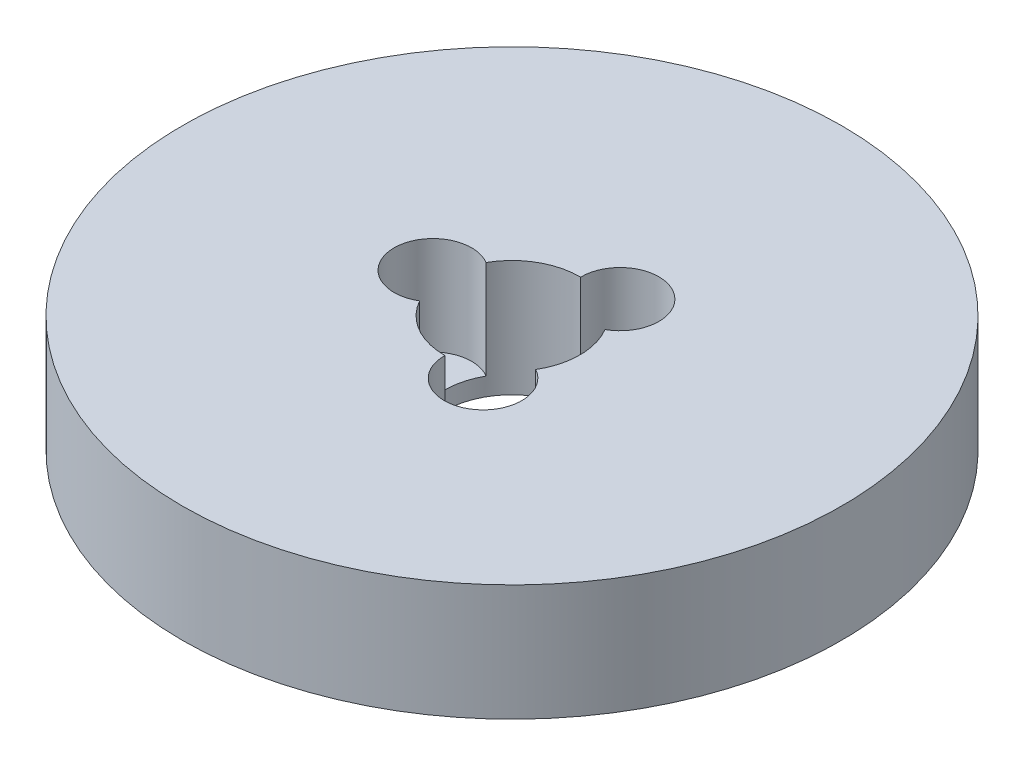
ISO-10303-21;
HEADER;
FILE_DESCRIPTION(('STEP AP214'),'2;1');
FILE_NAME('part.step','',(''),(''),'','','');
FILE_SCHEMA(('AUTOMOTIVE_DESIGN { 1 0 10303 214 1 1 1 1 }'));
ENDSEC;
DATA;
#1=APPLICATION_CONTEXT('core data for automotive mechanical design processes');
#2=APPLICATION_PROTOCOL_DEFINITION('international standard','automotive_design',2000,#1);
#3=PRODUCT_CONTEXT('',#1,'mechanical');
#4=PRODUCT('Part','Part','',(#3));
#5=PRODUCT_RELATED_PRODUCT_CATEGORY('part','',(#4));
#6=PRODUCT_DEFINITION_FORMATION('','',#4);
#7=PRODUCT_DEFINITION_CONTEXT('part definition',#1,'design');
#8=PRODUCT_DEFINITION('design','',#6,#7);
#9=PRODUCT_DEFINITION_SHAPE('','',#8);
#10=(LENGTH_UNIT() NAMED_UNIT(*) SI_UNIT(.MILLI.,.METRE.));
#11=(NAMED_UNIT(*) PLANE_ANGLE_UNIT() SI_UNIT($,.RADIAN.));
#12=(NAMED_UNIT(*) SI_UNIT($,.STERADIAN.) SOLID_ANGLE_UNIT());
#13=UNCERTAINTY_MEASURE_WITH_UNIT(LENGTH_MEASURE(1.E-05),#10,'distance_accuracy_value','');
#14=(GEOMETRIC_REPRESENTATION_CONTEXT(3) GLOBAL_UNCERTAINTY_ASSIGNED_CONTEXT((#13)) GLOBAL_UNIT_ASSIGNED_CONTEXT((#10,
#11,#12)) REPRESENTATION_CONTEXT('',''));
#15=CARTESIAN_POINT('',(0.,0.,0.));
#16=DIRECTION('',(0.,0.,1.));
#17=DIRECTION('',(1.,0.,0.));
#18=AXIS2_PLACEMENT_3D('',#15,#16,#17);
#19=CARTESIAN_POINT('',(0.,30.,0.));
#20=DIRECTION('',(0.,-1.,0.));
#21=DIRECTION('',(0.,0.,-1.));
#22=AXIS2_PLACEMENT_3D('',#19,#20,#21);
#23=CYLINDRICAL_SURFACE('',#22,85.);
#24=CARTESIAN_POINT('',(0.,30.,0.));
#25=DIRECTION('',(0.,1.,0.));
#26=DIRECTION('',(0.,0.,1.));
#27=AXIS2_PLACEMENT_3D('',#24,#25,#26);
#28=CIRCLE('',#27,85.);
#29=CARTESIAN_POINT('',(0.,30.,85.));
#30=VERTEX_POINT('',#29);
#31=EDGE_CURVE('E126',#30,#30,#28,.T.);
#32=ORIENTED_EDGE('',*,*,#31,.F.);
#33=EDGE_LOOP('',(#32));
#34=FACE_BOUND('',#33,.T.);
#35=CARTESIAN_POINT('',(0.,0.,0.));
#36=DIRECTION('',(0.,1.,0.));
#37=DIRECTION('',(0.,0.,1.));
#38=AXIS2_PLACEMENT_3D('',#35,#36,#37);
#39=CIRCLE('',#38,85.);
#40=CARTESIAN_POINT('',(0.,0.,85.));
#41=VERTEX_POINT('',#40);
#42=EDGE_CURVE('E124',#41,#41,#39,.T.);
#43=ORIENTED_EDGE('',*,*,#42,.T.);
#44=EDGE_LOOP('',(#43));
#45=FACE_BOUND('',#44,.T.);
#46=ADVANCED_FACE('F39',(#34,#45),#23,.T.);
#47=CARTESIAN_POINT('',(0.,30.,0.));
#48=DIRECTION('',(0.,1.,0.));
#49=DIRECTION('',(0.,0.,1.));
#50=AXIS2_PLACEMENT_3D('',#47,#48,#49);
#51=PLANE('',#50);
#52=CARTESIAN_POINT('',(10.2060339267064,30.,17.6773693048269));
#53=DIRECTION('',(0.,1.,0.));
#54=DIRECTION('',(0.866025403784436,0.,-0.500000000000004));
#55=AXIS2_PLACEMENT_3D('',#52,#53,#54);
#56=CIRCLE('',#55,10.);
#57=CARTESIAN_POINT('',(0.207628970782858,30.,17.4987682483794));
#58=VERTEX_POINT('',#57);
#59=CARTESIAN_POINT('',(15.0505633526418,30.,8.92919608744915));
#60=VERTEX_POINT('',#59);
#61=EDGE_CURVE('E147',#58,#60,#56,.T.);
#62=ORIENTED_EDGE('',*,*,#61,.F.);
#63=CARTESIAN_POINT('',(0.,30.,0.));
#64=DIRECTION('',(0.,1.,0.));
#65=DIRECTION('',(0.,0.,1.));
#66=AXIS2_PLACEMENT_3D('',#63,#64,#65);
#67=CIRCLE('',#66,17.5);
#68=CARTESIAN_POINT('',(-15.2581923234245,30.,8.56957216093021));
#69=VERTEX_POINT('',#68);
#70=EDGE_CURVE('E118',#69,#58,#67,.T.);
#71=ORIENTED_EDGE('',*,*,#70,.F.);
#72=CARTESIAN_POINT('',(-20.4120678534126,30.,0.));
#73=DIRECTION('',(0.,1.,0.));
#74=DIRECTION('',(0.,0.,1.));
#75=AXIS2_PLACEMENT_3D('',#72,#73,#74);
#76=CIRCLE('',#75,10.);
#77=CARTESIAN_POINT('',(-15.2581923234245,30.,-8.56957216093021));
#78=VERTEX_POINT('',#77);
#79=EDGE_CURVE('E113',#78,#69,#76,.T.);
#80=ORIENTED_EDGE('',*,*,#79,.F.);
#81=CARTESIAN_POINT('',(0.207628970782612,30.,-17.4987682483794));
#82=VERTEX_POINT('',#81);
#83=EDGE_CURVE('E106',#82,#78,#67,.T.);
#84=ORIENTED_EDGE('',*,*,#83,.F.);
#85=CARTESIAN_POINT('',(10.2060339267061,30.,-17.6773693048271));
#86=DIRECTION('',(0.,1.,0.));
#87=DIRECTION('',(-0.866025403784443,0.,-0.499999999999992));
#88=AXIS2_PLACEMENT_3D('',#85,#86,#87);
#89=CIRCLE('',#88,10.);
#90=CARTESIAN_POINT('',(15.0505633526416,30.,-8.92919608744935));
#91=VERTEX_POINT('',#90);
#92=EDGE_CURVE('E90',#91,#82,#89,.T.);
#93=ORIENTED_EDGE('',*,*,#92,.F.);
#94=EDGE_CURVE('E116',#60,#91,#67,.T.);
#95=ORIENTED_EDGE('',*,*,#94,.F.);
#96=EDGE_LOOP('',(#62,#71,#80,#84,#93,#95));
#97=FACE_BOUND('',#96,.T.);
#98=ORIENTED_EDGE('',*,*,#31,.T.);
#99=EDGE_LOOP('',(#98));
#100=FACE_BOUND('',#99,.T.);
#101=ADVANCED_FACE('F115',(#97,#100),#51,.T.);
#102=CARTESIAN_POINT('',(0.,0.,0.));
#103=DIRECTION('',(0.,1.,0.));
#104=DIRECTION('',(0.,0.,1.));
#105=AXIS2_PLACEMENT_3D('',#102,#103,#104);
#106=PLANE('',#105);
#107=CARTESIAN_POINT('',(0.,0.,0.));
#108=DIRECTION('',(0.,1.,0.));
#109=DIRECTION('',(0.,0.,1.));
#110=AXIS2_PLACEMENT_3D('',#107,#108,#109);
#111=CIRCLE('',#110,17.5);
#112=CARTESIAN_POINT('',(0.,0.,17.5));
#113=VERTEX_POINT('',#112);
#114=EDGE_CURVE('E120',#113,#113,#111,.T.);
#115=ORIENTED_EDGE('',*,*,#114,.T.);
#116=EDGE_LOOP('',(#115));
#117=FACE_BOUND('',#116,.T.);
#118=ORIENTED_EDGE('',*,*,#42,.F.);
#119=EDGE_LOOP('',(#118));
#120=FACE_BOUND('',#119,.T.);
#121=ADVANCED_FACE('F164',(#117,#120),#106,.F.);
#122=CARTESIAN_POINT('',(0.,30.,0.));
#123=DIRECTION('',(0.,-1.,0.));
#124=DIRECTION('',(0.,0.,-1.));
#125=AXIS2_PLACEMENT_3D('',#122,#123,#124);
#126=CYLINDRICAL_SURFACE('',#125,17.5);
#127=DIRECTION('',(0.,1.,0.));
#128=VECTOR('',#127,1.);
#129=CARTESIAN_POINT('',(0.207628970782858,17.3187324811393,17.4987682483794));
#130=LINE('',#129,#128);
#131=CARTESIAN_POINT('',(0.207628970782858,4.6374649622787,17.4987682483794));
#132=VERTEX_POINT('',#131);
#133=EDGE_CURVE('E11',#132,#58,#130,.T.);
#134=ORIENTED_EDGE('',*,*,#133,.F.);
#135=CARTESIAN_POINT('',(0.,4.6374649622787,0.));
#136=DIRECTION('',(0.,1.,0.));
#137=DIRECTION('',(0.,0.,1.));
#138=AXIS2_PLACEMENT_3D('',#135,#136,#137);
#139=CIRCLE('',#138,17.5);
#140=CARTESIAN_POINT('',(15.0505633526418,4.6374649622787,8.92919608744915));
#141=VERTEX_POINT('',#140);
#142=EDGE_CURVE('E144',#132,#141,#139,.T.);
#143=ORIENTED_EDGE('',*,*,#142,.T.);
#144=DIRECTION('',(0.,1.,0.));
#145=VECTOR('',#144,1.);
#146=CARTESIAN_POINT('',(15.0505633526418,17.3187324811393,8.92919608744915));
#147=LINE('',#146,#145);
#148=EDGE_CURVE('E46',#60,#141,#147,.F.);
#149=ORIENTED_EDGE('',*,*,#148,.F.);
#150=ORIENTED_EDGE('',*,*,#94,.T.);
#151=DIRECTION('',(0.,1.,0.));
#152=VECTOR('',#151,1.);
#153=CARTESIAN_POINT('',(15.0505633526416,17.3187324811393,-8.92919608744935));
#154=LINE('',#153,#152);
#155=CARTESIAN_POINT('',(15.0505633526416,4.6374649622787,-8.92919608744935));
#156=VERTEX_POINT('',#155);
#157=EDGE_CURVE('E92',#156,#91,#154,.T.);
#158=ORIENTED_EDGE('',*,*,#157,.F.);
#159=CARTESIAN_POINT('',(0.,4.6374649622787,0.));
#160=DIRECTION('',(0.,1.,0.));
#161=DIRECTION('',(0.,0.,1.));
#162=AXIS2_PLACEMENT_3D('',#159,#160,#161);
#163=CIRCLE('',#162,17.5);
#164=CARTESIAN_POINT('',(0.207628970782612,4.6374649622787,-17.4987682483794));
#165=VERTEX_POINT('',#164);
#166=EDGE_CURVE('E107',#156,#165,#163,.T.);
#167=ORIENTED_EDGE('',*,*,#166,.T.);
#168=DIRECTION('',(0.,1.,0.));
#169=VECTOR('',#168,1.);
#170=CARTESIAN_POINT('',(0.207628970782612,17.3187324811393,-17.4987682483794));
#171=LINE('',#170,#169);
#172=EDGE_CURVE('E95',#82,#165,#171,.F.);
#173=ORIENTED_EDGE('',*,*,#172,.F.);
#174=ORIENTED_EDGE('',*,*,#83,.T.);
#175=DIRECTION('',(0.,1.,0.));
#176=VECTOR('',#175,1.);
#177=CARTESIAN_POINT('',(-15.2581923234245,17.3187324811393,-8.56957216093021));
#178=LINE('',#177,#176);
#179=CARTESIAN_POINT('',(-15.2581923234245,4.6374649622787,-8.56957216093021));
#180=VERTEX_POINT('',#179);
#181=EDGE_CURVE('E143',#180,#78,#178,.T.);
#182=ORIENTED_EDGE('',*,*,#181,.F.);
#183=CARTESIAN_POINT('',(0.,4.6374649622787,0.));
#184=DIRECTION('',(0.,1.,0.));
#185=DIRECTION('',(0.,0.,1.));
#186=AXIS2_PLACEMENT_3D('',#183,#184,#185);
#187=CIRCLE('',#186,17.5);
#188=CARTESIAN_POINT('',(-15.2581923234245,4.6374649622787,8.56957216093021));
#189=VERTEX_POINT('',#188);
#190=EDGE_CURVE('E132',#180,#189,#187,.T.);
#191=ORIENTED_EDGE('',*,*,#190,.T.);
#192=DIRECTION('',(0.,1.,0.));
#193=VECTOR('',#192,1.);
#194=CARTESIAN_POINT('',(-15.2581923234245,17.3187324811393,8.56957216093021));
#195=LINE('',#194,#193);
#196=EDGE_CURVE('E137',#69,#189,#195,.F.);
#197=ORIENTED_EDGE('',*,*,#196,.F.);
#198=ORIENTED_EDGE('',*,*,#70,.T.);
#199=EDGE_LOOP('',(#134,#143,#149,#150,#158,#167,#173,#174,#182,#191,#197,#198));
#200=FACE_BOUND('',#199,.T.);
#201=ORIENTED_EDGE('',*,*,#114,.F.);
#202=EDGE_LOOP('',(#201));
#203=FACE_BOUND('',#202,.T.);
#204=ADVANCED_FACE('F103',(#200,#203),#126,.F.);
#205=CARTESIAN_POINT('',(-20.4120678534126,4.6374649622787,0.));
#206=DIRECTION('',(0.,1.,0.));
#207=DIRECTION('',(0.,0.,1.));
#208=AXIS2_PLACEMENT_3D('',#205,#206,#207);
#209=CYLINDRICAL_SURFACE('',#208,10.);
#210=ORIENTED_EDGE('',*,*,#181,.T.);
#211=ORIENTED_EDGE('',*,*,#79,.T.);
#212=ORIENTED_EDGE('',*,*,#196,.T.);
#213=CARTESIAN_POINT('',(-20.4120678534126,4.6374649622787,0.));
#214=DIRECTION('',(0.,1.,0.));
#215=DIRECTION('',(0.,0.,1.));
#216=AXIS2_PLACEMENT_3D('',#213,#214,#215);
#217=CIRCLE('',#216,10.);
#218=EDGE_CURVE('E121',#180,#189,#217,.T.);
#219=ORIENTED_EDGE('',*,*,#218,.F.);
#220=EDGE_LOOP('',(#210,#211,#212,#219));
#221=FACE_BOUND('',#220,.T.);
#222=ADVANCED_FACE('F174',(#221),#209,.F.);
#223=CARTESIAN_POINT('',(-20.4120678534126,4.6374649622787,0.));
#224=DIRECTION('',(0.,1.,0.));
#225=DIRECTION('',(0.,0.,1.));
#226=AXIS2_PLACEMENT_3D('',#223,#224,#225);
#227=PLANE('',#226);
#228=ORIENTED_EDGE('',*,*,#218,.T.);
#229=ORIENTED_EDGE('',*,*,#190,.F.);
#230=EDGE_LOOP('',(#228,#229));
#231=FACE_BOUND('',#230,.T.);
#232=ADVANCED_FACE('F177',(#231),#227,.T.);
#233=CARTESIAN_POINT('',(10.2060339267061,4.6374649622787,-17.6773693048271));
#234=DIRECTION('',(0.,1.,0.));
#235=DIRECTION('',(0.,0.,1.));
#236=AXIS2_PLACEMENT_3D('',#233,#234,#235);
#237=CYLINDRICAL_SURFACE('',#236,10.);
#238=ORIENTED_EDGE('',*,*,#157,.T.);
#239=ORIENTED_EDGE('',*,*,#92,.T.);
#240=ORIENTED_EDGE('',*,*,#172,.T.);
#241=CARTESIAN_POINT('',(10.2060339267061,4.6374649622787,-17.6773693048271));
#242=DIRECTION('',(0.,1.,0.));
#243=DIRECTION('',(-0.866025403784443,0.,-0.499999999999992));
#244=AXIS2_PLACEMENT_3D('',#241,#242,#243);
#245=CIRCLE('',#244,10.);
#246=EDGE_CURVE('E56',#156,#165,#245,.T.);
#247=ORIENTED_EDGE('',*,*,#246,.F.);
#248=EDGE_LOOP('',(#238,#239,#240,#247));
#249=FACE_BOUND('',#248,.T.);
#250=ADVANCED_FACE('F93',(#249),#237,.F.);
#251=CARTESIAN_POINT('',(10.2060339267061,4.6374649622787,-17.6773693048271));
#252=DIRECTION('',(0.,1.,0.));
#253=DIRECTION('',(-0.866025403784443,0.,-0.499999999999992));
#254=AXIS2_PLACEMENT_3D('',#251,#252,#253);
#255=PLANE('',#254);
#256=ORIENTED_EDGE('',*,*,#246,.T.);
#257=ORIENTED_EDGE('',*,*,#166,.F.);
#258=EDGE_LOOP('',(#256,#257));
#259=FACE_BOUND('',#258,.T.);
#260=ADVANCED_FACE('F160',(#259),#255,.T.);
#261=CARTESIAN_POINT('',(10.2060339267064,4.6374649622787,17.6773693048269));
#262=DIRECTION('',(0.,1.,0.));
#263=DIRECTION('',(0.,0.,1.));
#264=AXIS2_PLACEMENT_3D('',#261,#262,#263);
#265=CYLINDRICAL_SURFACE('',#264,10.);
#266=ORIENTED_EDGE('',*,*,#133,.T.);
#267=ORIENTED_EDGE('',*,*,#61,.T.);
#268=ORIENTED_EDGE('',*,*,#148,.T.);
#269=CARTESIAN_POINT('',(10.2060339267064,4.6374649622787,17.6773693048269));
#270=DIRECTION('',(0.,1.,0.));
#271=DIRECTION('',(0.866025403784436,0.,-0.500000000000004));
#272=AXIS2_PLACEMENT_3D('',#269,#270,#271);
#273=CIRCLE('',#272,10.);
#274=EDGE_CURVE('E55',#132,#141,#273,.T.);
#275=ORIENTED_EDGE('',*,*,#274,.F.);
#276=EDGE_LOOP('',(#266,#267,#268,#275));
#277=FACE_BOUND('',#276,.T.);
#278=ADVANCED_FACE('F149',(#277),#265,.F.);
#279=CARTESIAN_POINT('',(10.2060339267064,4.6374649622787,17.6773693048269));
#280=DIRECTION('',(0.,1.,0.));
#281=DIRECTION('',(0.866025403784436,0.,-0.500000000000004));
#282=AXIS2_PLACEMENT_3D('',#279,#280,#281);
#283=PLANE('',#282);
#284=ORIENTED_EDGE('',*,*,#274,.T.);
#285=ORIENTED_EDGE('',*,*,#142,.F.);
#286=EDGE_LOOP('',(#284,#285));
#287=FACE_BOUND('',#286,.T.);
#288=ADVANCED_FACE('F151',(#287),#283,.T.);
#289=CLOSED_SHELL('',(#46,#101,#121,#204,#222,#232,#250,#260,#278,#288));
#290=MANIFOLD_SOLID_BREP('B2',#289);
#291=ADVANCED_BREP_SHAPE_REPRESENTATION('',(#18,#290),#14);
#292=SHAPE_DEFINITION_REPRESENTATION(#9,#291);
ENDSEC;
END-ISO-10303-21;
